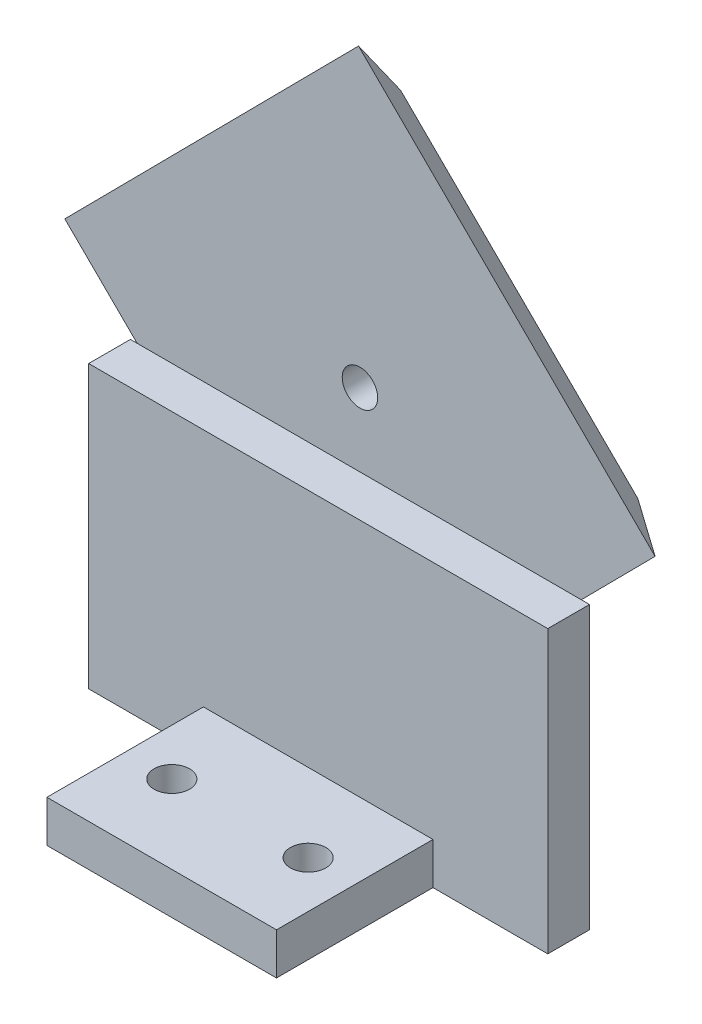
ISO-10303-21;
HEADER;
FILE_DESCRIPTION(('STEP AP214'),'2;1');
FILE_NAME('part.step','',(''),(''),'','','');
FILE_SCHEMA(('AUTOMOTIVE_DESIGN { 1 0 10303 214 1 1 1 1 }'));
ENDSEC;
DATA;
#1=APPLICATION_CONTEXT('core data for automotive mechanical design processes');
#2=APPLICATION_PROTOCOL_DEFINITION('international standard','automotive_design',2000,#1);
#3=PRODUCT_CONTEXT('',#1,'mechanical');
#4=PRODUCT('Part','Part','',(#3));
#5=PRODUCT_RELATED_PRODUCT_CATEGORY('part','',(#4));
#6=PRODUCT_DEFINITION_FORMATION('','',#4);
#7=PRODUCT_DEFINITION_CONTEXT('part definition',#1,'design');
#8=PRODUCT_DEFINITION('design','',#6,#7);
#9=PRODUCT_DEFINITION_SHAPE('','',#8);
#10=(LENGTH_UNIT() NAMED_UNIT(*) SI_UNIT(.MILLI.,.METRE.));
#11=(NAMED_UNIT(*) PLANE_ANGLE_UNIT() SI_UNIT($,.RADIAN.));
#12=(NAMED_UNIT(*) SI_UNIT($,.STERADIAN.) SOLID_ANGLE_UNIT());
#13=UNCERTAINTY_MEASURE_WITH_UNIT(LENGTH_MEASURE(1.E-05),#10,'distance_accuracy_value','');
#14=(GEOMETRIC_REPRESENTATION_CONTEXT(3) GLOBAL_UNCERTAINTY_ASSIGNED_CONTEXT((#13)) GLOBAL_UNIT_ASSIGNED_CONTEXT((#10,
#11,#12)) REPRESENTATION_CONTEXT('',''));
#15=CARTESIAN_POINT('',(0.,0.,0.));
#16=DIRECTION('',(0.,0.,1.));
#17=DIRECTION('',(1.,0.,0.));
#18=AXIS2_PLACEMENT_3D('',#15,#16,#17);
#19=CARTESIAN_POINT('',(0.,27.,-11.5));
#20=DIRECTION('',(0.,0.,-1.));
#21=DIRECTION('',(-1.,0.,0.));
#22=AXIS2_PLACEMENT_3D('',#19,#20,#21);
#23=PLANE('',#22);
#24=DIRECTION('',(1.,0.,0.));
#25=VECTOR('',#24,1.);
#26=CARTESIAN_POINT('',(0.,4.,-11.5));
#27=LINE('',#26,#25);
#28=CARTESIAN_POINT('',(-11.,4.,-11.5));
#29=VERTEX_POINT('',#28);
#30=CARTESIAN_POINT('',(11.,4.,-11.5));
#31=VERTEX_POINT('',#30);
#32=EDGE_CURVE('E183',#29,#31,#27,.T.);
#33=ORIENTED_EDGE('',*,*,#32,.F.);
#34=DIRECTION('',(0.,-1.,0.));
#35=VECTOR('',#34,1.);
#36=CARTESIAN_POINT('',(-11.,4.,-11.5));
#37=LINE('',#36,#35);
#38=CARTESIAN_POINT('',(-11.,0.,-11.5));
#39=VERTEX_POINT('',#38);
#40=EDGE_CURVE('E179',#29,#39,#37,.T.);
#41=ORIENTED_EDGE('',*,*,#40,.T.);
#42=DIRECTION('',(1.,0.,0.));
#43=VECTOR('',#42,1.);
#44=CARTESIAN_POINT('',(0.,0.,-11.5));
#45=LINE('',#44,#43);
#46=CARTESIAN_POINT('',(-22.,0.,-11.5));
#47=VERTEX_POINT('',#46);
#48=EDGE_CURVE('E241',#47,#39,#45,.T.);
#49=ORIENTED_EDGE('',*,*,#48,.F.);
#50=DIRECTION('',(0.,-1.,0.));
#51=VECTOR('',#50,1.);
#52=CARTESIAN_POINT('',(-22.,27.,-11.5));
#53=LINE('',#52,#51);
#54=CARTESIAN_POINT('',(-22.,27.,-11.5));
#55=VERTEX_POINT('',#54);
#56=EDGE_CURVE('E259',#55,#47,#53,.T.);
#57=ORIENTED_EDGE('',*,*,#56,.F.);
#58=DIRECTION('',(1.,0.,0.));
#59=VECTOR('',#58,1.);
#60=CARTESIAN_POINT('',(0.,27.,-11.5));
#61=LINE('',#60,#59);
#62=CARTESIAN_POINT('',(-21.3537768941877,27.,-11.5));
#63=VERTEX_POINT('',#62);
#64=EDGE_CURVE('E223',#55,#63,#61,.T.);
#65=ORIENTED_EDGE('',*,*,#64,.T.);
#66=DIRECTION('',(0.71050638860482,-0.703690750082546,0.));
#67=VECTOR('',#66,1.);
#68=CARTESIAN_POINT('',(-10.5739775869006,16.3236075256414,-11.5));
#69=LINE('',#68,#67);
#70=CARTESIAN_POINT('',(0.13631277044548,5.71605722625266,-11.5));
#71=VERTEX_POINT('',#70);
#72=EDGE_CURVE('E353',#71,#63,#69,.F.);
#73=ORIENTED_EDGE('',*,*,#72,.F.);
#74=DIRECTION('',(0.703690750082546,0.71050638860482,0.));
#75=VECTOR('',#74,1.);
#76=CARTESIAN_POINT('',(10.7102903573461,16.3924497006112,-11.5));
#77=LINE('',#76,#75);
#78=CARTESIAN_POINT('',(21.2160861481097,27.,-11.5));
#79=VERTEX_POINT('',#78);
#80=EDGE_CURVE('E11',#79,#71,#77,.F.);
#81=ORIENTED_EDGE('',*,*,#80,.F.);
#82=CARTESIAN_POINT('',(22.,27.,-11.5));
#83=VERTEX_POINT('',#82);
#84=EDGE_CURVE('E221',#79,#83,#61,.T.);
#85=ORIENTED_EDGE('',*,*,#84,.T.);
#86=DIRECTION('',(0.,-1.,0.));
#87=VECTOR('',#86,1.);
#88=CARTESIAN_POINT('',(22.,27.,-11.5));
#89=LINE('',#88,#87);
#90=CARTESIAN_POINT('',(22.,0.,-11.5));
#91=VERTEX_POINT('',#90);
#92=EDGE_CURVE('E262',#83,#91,#89,.T.);
#93=ORIENTED_EDGE('',*,*,#92,.T.);
#94=CARTESIAN_POINT('',(11.,0.,-11.5));
#95=VERTEX_POINT('',#94);
#96=EDGE_CURVE('E239',#95,#91,#45,.T.);
#97=ORIENTED_EDGE('',*,*,#96,.F.);
#98=DIRECTION('',(0.,-1.,0.));
#99=VECTOR('',#98,1.);
#100=CARTESIAN_POINT('',(11.,4.,-11.5));
#101=LINE('',#100,#99);
#102=EDGE_CURVE('E205',#31,#95,#101,.T.);
#103=ORIENTED_EDGE('',*,*,#102,.F.);
#104=EDGE_LOOP('',(#33,#41,#49,#57,#65,#73,#81,#85,#93,#97,#103));
#105=FACE_BOUND('',#104,.T.);
#106=ADVANCED_FACE('F41',(#105),#23,.T.);
#107=CARTESIAN_POINT('',(0.,0.,0.));
#108=DIRECTION('',(0.,1.,0.));
#109=DIRECTION('',(0.,0.,1.));
#110=AXIS2_PLACEMENT_3D('',#107,#108,#109);
#111=PLANE('',#110);
#112=CARTESIAN_POINT('',(-6.5317185165128,0.,0.));
#113=DIRECTION('',(0.,-1.,0.));
#114=DIRECTION('',(0.,0.,-1.));
#115=AXIS2_PLACEMENT_3D('',#112,#113,#114);
#116=CIRCLE('',#115,3.15);
#117=CARTESIAN_POINT('',(-6.5317185165128,0.,-3.15));
#118=VERTEX_POINT('',#117);
#119=EDGE_CURVE('E278',#118,#118,#116,.T.);
#120=ORIENTED_EDGE('',*,*,#119,.F.);
#121=EDGE_LOOP('',(#120));
#122=FACE_BOUND('',#121,.T.);
#123=DIRECTION('',(0.,0.,1.));
#124=VECTOR('',#123,1.);
#125=CARTESIAN_POINT('',(-11.,0.,0.));
#126=LINE('',#125,#124);
#127=CARTESIAN_POINT('',(-11.,0.,-7.5));
#128=VERTEX_POINT('',#127);
#129=CARTESIAN_POINT('',(-11.,0.,7.5));
#130=VERTEX_POINT('',#129);
#131=EDGE_CURVE('E290',#128,#130,#126,.T.);
#132=ORIENTED_EDGE('',*,*,#131,.F.);
#133=DIRECTION('',(1.,0.,0.));
#134=VECTOR('',#133,1.);
#135=CARTESIAN_POINT('',(0.,0.,-7.5));
#136=LINE('',#135,#134);
#137=CARTESIAN_POINT('',(-22.,0.,-7.5));
#138=VERTEX_POINT('',#137);
#139=EDGE_CURVE('E222',#138,#128,#136,.T.);
#140=ORIENTED_EDGE('',*,*,#139,.F.);
#141=DIRECTION('',(0.,0.,1.));
#142=VECTOR('',#141,1.);
#143=CARTESIAN_POINT('',(-22.,0.,0.));
#144=LINE('',#143,#142);
#145=EDGE_CURVE('E245',#47,#138,#144,.T.);
#146=ORIENTED_EDGE('',*,*,#145,.F.);
#147=ORIENTED_EDGE('',*,*,#48,.T.);
#148=DIRECTION('',(0.,0.,1.));
#149=VECTOR('',#148,1.);
#150=CARTESIAN_POINT('',(-11.,0.,0.));
#151=LINE('',#150,#149);
#152=CARTESIAN_POINT('',(-11.,0.,-21.5));
#153=VERTEX_POINT('',#152);
#154=EDGE_CURVE('E413',#153,#39,#151,.T.);
#155=ORIENTED_EDGE('',*,*,#154,.F.);
#156=DIRECTION('',(-1.,0.,0.));
#157=VECTOR('',#156,1.);
#158=CARTESIAN_POINT('',(0.,0.,-21.5));
#159=LINE('',#158,#157);
#160=CARTESIAN_POINT('',(11.,0.,-21.5));
#161=VERTEX_POINT('',#160);
#162=EDGE_CURVE('E196',#161,#153,#159,.T.);
#163=ORIENTED_EDGE('',*,*,#162,.F.);
#164=DIRECTION('',(0.,0.,-1.));
#165=VECTOR('',#164,1.);
#166=CARTESIAN_POINT('',(11.,0.,0.));
#167=LINE('',#166,#165);
#168=EDGE_CURVE('E59',#95,#161,#167,.T.);
#169=ORIENTED_EDGE('',*,*,#168,.F.);
#170=ORIENTED_EDGE('',*,*,#96,.T.);
#171=DIRECTION('',(0.,0.,1.));
#172=VECTOR('',#171,1.);
#173=CARTESIAN_POINT('',(22.,0.,0.));
#174=LINE('',#173,#172);
#175=CARTESIAN_POINT('',(22.,0.,-7.5));
#176=VERTEX_POINT('',#175);
#177=EDGE_CURVE('E235',#91,#176,#174,.T.);
#178=ORIENTED_EDGE('',*,*,#177,.T.);
#179=CARTESIAN_POINT('',(11.,0.,-7.5));
#180=VERTEX_POINT('',#179);
#181=EDGE_CURVE('E248',#180,#176,#136,.T.);
#182=ORIENTED_EDGE('',*,*,#181,.F.);
#183=DIRECTION('',(0.,0.,1.));
#184=VECTOR('',#183,1.);
#185=CARTESIAN_POINT('',(11.,0.,0.));
#186=LINE('',#185,#184);
#187=CARTESIAN_POINT('',(11.,0.,7.5));
#188=VERTEX_POINT('',#187);
#189=EDGE_CURVE('E296',#180,#188,#186,.T.);
#190=ORIENTED_EDGE('',*,*,#189,.T.);
#191=DIRECTION('',(-1.,0.,0.));
#192=VECTOR('',#191,1.);
#193=CARTESIAN_POINT('',(0.,0.,7.5));
#194=LINE('',#193,#192);
#195=EDGE_CURVE('E311',#188,#130,#194,.T.);
#196=ORIENTED_EDGE('',*,*,#195,.T.);
#197=EDGE_LOOP('',(#132,#140,#146,#147,#155,#163,#169,#170,#178,#182,#190,#196));
#198=FACE_BOUND('',#197,.T.);
#199=CARTESIAN_POINT('',(6.5317185165128,0.,0.));
#200=DIRECTION('',(0.,-1.,0.));
#201=DIRECTION('',(0.,0.,-1.));
#202=AXIS2_PLACEMENT_3D('',#199,#200,#201);
#203=CIRCLE('',#202,3.15);
#204=CARTESIAN_POINT('',(6.5317185165128,0.,-3.15));
#205=VERTEX_POINT('',#204);
#206=EDGE_CURVE('E266',#205,#205,#203,.T.);
#207=ORIENTED_EDGE('',*,*,#206,.F.);
#208=EDGE_LOOP('',(#207));
#209=FACE_BOUND('',#208,.T.);
#210=ADVANCED_FACE('F400',(#122,#198,#209),#111,.F.);
#211=CARTESIAN_POINT('',(-11.,4.,0.));
#212=DIRECTION('',(1.,0.,0.));
#213=DIRECTION('',(0.,0.,-1.));
#214=AXIS2_PLACEMENT_3D('',#211,#212,#213);
#215=PLANE('',#214);
#216=ORIENTED_EDGE('',*,*,#131,.T.);
#217=DIRECTION('',(0.,-1.,0.));
#218=VECTOR('',#217,1.);
#219=CARTESIAN_POINT('',(-11.,4.,7.5));
#220=LINE('',#219,#218);
#221=CARTESIAN_POINT('',(-11.,4.,7.5));
#222=VERTEX_POINT('',#221);
#223=EDGE_CURVE('E324',#222,#130,#220,.T.);
#224=ORIENTED_EDGE('',*,*,#223,.F.);
#225=DIRECTION('',(0.,0.,1.));
#226=VECTOR('',#225,1.);
#227=CARTESIAN_POINT('',(-11.,4.,0.));
#228=LINE('',#227,#226);
#229=CARTESIAN_POINT('',(-11.,4.,-7.5));
#230=VERTEX_POINT('',#229);
#231=EDGE_CURVE('E295',#230,#222,#228,.T.);
#232=ORIENTED_EDGE('',*,*,#231,.F.);
#233=DIRECTION('',(0.,-1.,0.));
#234=VECTOR('',#233,1.);
#235=CARTESIAN_POINT('',(-11.,4.,-7.5));
#236=LINE('',#235,#234);
#237=EDGE_CURVE('E51',#230,#128,#236,.T.);
#238=ORIENTED_EDGE('',*,*,#237,.T.);
#239=EDGE_LOOP('',(#216,#224,#232,#238));
#240=FACE_BOUND('',#239,.T.);
#241=ADVANCED_FACE('F430',(#240),#215,.F.);
#242=CARTESIAN_POINT('',(0.,4.,7.5));
#243=DIRECTION('',(0.,0.,1.));
#244=DIRECTION('',(1.,0.,0.));
#245=AXIS2_PLACEMENT_3D('',#242,#243,#244);
#246=PLANE('',#245);
#247=ORIENTED_EDGE('',*,*,#195,.F.);
#248=DIRECTION('',(0.,-1.,0.));
#249=VECTOR('',#248,1.);
#250=CARTESIAN_POINT('',(11.,4.,7.5));
#251=LINE('',#250,#249);
#252=CARTESIAN_POINT('',(11.,4.,7.5));
#253=VERTEX_POINT('',#252);
#254=EDGE_CURVE('E321',#253,#188,#251,.T.);
#255=ORIENTED_EDGE('',*,*,#254,.F.);
#256=DIRECTION('',(-1.,0.,0.));
#257=VECTOR('',#256,1.);
#258=CARTESIAN_POINT('',(0.,4.,7.5));
#259=LINE('',#258,#257);
#260=EDGE_CURVE('E299',#253,#222,#259,.T.);
#261=ORIENTED_EDGE('',*,*,#260,.T.);
#262=ORIENTED_EDGE('',*,*,#223,.T.);
#263=EDGE_LOOP('',(#247,#255,#261,#262));
#264=FACE_BOUND('',#263,.T.);
#265=ADVANCED_FACE('F439',(#264),#246,.T.);
#266=CARTESIAN_POINT('',(11.,4.,0.));
#267=DIRECTION('',(1.,0.,0.));
#268=DIRECTION('',(0.,0.,-1.));
#269=AXIS2_PLACEMENT_3D('',#266,#267,#268);
#270=PLANE('',#269);
#271=ORIENTED_EDGE('',*,*,#189,.F.);
#272=DIRECTION('',(0.,-1.,0.));
#273=VECTOR('',#272,1.);
#274=CARTESIAN_POINT('',(11.,4.,-7.5));
#275=LINE('',#274,#273);
#276=CARTESIAN_POINT('',(11.,4.,-7.5));
#277=VERTEX_POINT('',#276);
#278=EDGE_CURVE('E307',#277,#180,#275,.T.);
#279=ORIENTED_EDGE('',*,*,#278,.F.);
#280=DIRECTION('',(0.,0.,1.));
#281=VECTOR('',#280,1.);
#282=CARTESIAN_POINT('',(11.,4.,0.));
#283=LINE('',#282,#281);
#284=EDGE_CURVE('E303',#277,#253,#283,.T.);
#285=ORIENTED_EDGE('',*,*,#284,.T.);
#286=ORIENTED_EDGE('',*,*,#254,.T.);
#287=EDGE_LOOP('',(#271,#279,#285,#286));
#288=FACE_BOUND('',#287,.T.);
#289=ADVANCED_FACE('F437',(#288),#270,.T.);
#290=CARTESIAN_POINT('',(0.,4.,0.));
#291=DIRECTION('',(0.,1.,0.));
#292=DIRECTION('',(0.,0.,1.));
#293=AXIS2_PLACEMENT_3D('',#290,#291,#292);
#294=PLANE('',#293);
#295=CARTESIAN_POINT('',(6.5317185165128,4.,0.));
#296=DIRECTION('',(0.,1.,0.));
#297=DIRECTION('',(0.,0.,1.));
#298=AXIS2_PLACEMENT_3D('',#295,#296,#297);
#299=CIRCLE('',#298,1.69999999999999);
#300=CARTESIAN_POINT('',(6.5317185165128,4.,1.69999999999999));
#301=VERTEX_POINT('',#300);
#302=EDGE_CURVE('E274',#301,#301,#299,.T.);
#303=ORIENTED_EDGE('',*,*,#302,.F.);
#304=EDGE_LOOP('',(#303));
#305=FACE_BOUND('',#304,.T.);
#306=CARTESIAN_POINT('',(-6.5317185165128,4.,0.));
#307=DIRECTION('',(0.,1.,0.));
#308=DIRECTION('',(0.,0.,1.));
#309=AXIS2_PLACEMENT_3D('',#306,#307,#308);
#310=CIRCLE('',#309,1.69999999999999);
#311=CARTESIAN_POINT('',(-6.5317185165128,4.,1.69999999999999));
#312=VERTEX_POINT('',#311);
#313=EDGE_CURVE('E286',#312,#312,#310,.T.);
#314=ORIENTED_EDGE('',*,*,#313,.F.);
#315=EDGE_LOOP('',(#314));
#316=FACE_BOUND('',#315,.T.);
#317=DIRECTION('',(-1.,0.,0.));
#318=VECTOR('',#317,1.);
#319=CARTESIAN_POINT('',(0.,4.,-7.5));
#320=LINE('',#319,#318);
#321=EDGE_CURVE('E291',#277,#230,#320,.T.);
#322=ORIENTED_EDGE('',*,*,#321,.T.);
#323=ORIENTED_EDGE('',*,*,#231,.T.);
#324=ORIENTED_EDGE('',*,*,#260,.F.);
#325=ORIENTED_EDGE('',*,*,#284,.F.);
#326=EDGE_LOOP('',(#322,#323,#324,#325));
#327=FACE_BOUND('',#326,.T.);
#328=ADVANCED_FACE('F434',(#305,#316,#327),#294,.T.);
#329=CARTESIAN_POINT('',(-6.5317185165128,0.,0.));
#330=DIRECTION('',(0.,-1.,0.));
#331=DIRECTION('',(0.,0.,-1.));
#332=AXIS2_PLACEMENT_3D('',#329,#330,#331);
#333=CYLINDRICAL_SURFACE('',#332,1.69999999999999);
#334=CARTESIAN_POINT('',(-6.5317185165128,1.45000000000001,0.));
#335=DIRECTION('',(0.,-1.,0.));
#336=DIRECTION('',(0.,0.,-1.));
#337=AXIS2_PLACEMENT_3D('',#334,#335,#336);
#338=CIRCLE('',#337,1.69999999999999);
#339=CARTESIAN_POINT('',(-6.5317185165128,1.45000000000001,-1.69999999999999));
#340=VERTEX_POINT('',#339);
#341=EDGE_CURVE('E282',#340,#340,#338,.T.);
#342=ORIENTED_EDGE('',*,*,#341,.T.);
#343=EDGE_LOOP('',(#342));
#344=FACE_BOUND('',#343,.T.);
#345=ORIENTED_EDGE('',*,*,#313,.T.);
#346=EDGE_LOOP('',(#345));
#347=FACE_BOUND('',#346,.T.);
#348=ADVANCED_FACE('F471',(#344,#347),#333,.F.);
#349=CARTESIAN_POINT('',(-6.5317185165128,0.,0.));
#350=DIRECTION('',(0.,-1.,0.));
#351=DIRECTION('',(0.,0.,-1.));
#352=AXIS2_PLACEMENT_3D('',#349,#350,#351);
#353=CONICAL_SURFACE('',#352,3.15,0.78539816339745);
#354=ORIENTED_EDGE('',*,*,#341,.F.);
#355=EDGE_LOOP('',(#354));
#356=FACE_BOUND('',#355,.T.);
#357=ORIENTED_EDGE('',*,*,#119,.T.);
#358=EDGE_LOOP('',(#357));
#359=FACE_BOUND('',#358,.T.);
#360=ADVANCED_FACE('F467',(#356,#359),#353,.F.);
#361=CARTESIAN_POINT('',(6.5317185165128,0.,0.));
#362=DIRECTION('',(0.,-1.,0.));
#363=DIRECTION('',(0.,0.,-1.));
#364=AXIS2_PLACEMENT_3D('',#361,#362,#363);
#365=CYLINDRICAL_SURFACE('',#364,1.69999999999999);
#366=CARTESIAN_POINT('',(6.5317185165128,1.45000000000001,0.));
#367=DIRECTION('',(0.,-1.,0.));
#368=DIRECTION('',(0.,0.,-1.));
#369=AXIS2_PLACEMENT_3D('',#366,#367,#368);
#370=CIRCLE('',#369,1.69999999999999);
#371=CARTESIAN_POINT('',(6.5317185165128,1.45000000000001,-1.69999999999999));
#372=VERTEX_POINT('',#371);
#373=EDGE_CURVE('E270',#372,#372,#370,.T.);
#374=ORIENTED_EDGE('',*,*,#373,.T.);
#375=EDGE_LOOP('',(#374));
#376=FACE_BOUND('',#375,.T.);
#377=ORIENTED_EDGE('',*,*,#302,.T.);
#378=EDGE_LOOP('',(#377));
#379=FACE_BOUND('',#378,.T.);
#380=ADVANCED_FACE('F463',(#376,#379),#365,.F.);
#381=CARTESIAN_POINT('',(6.5317185165128,0.,0.));
#382=DIRECTION('',(0.,-1.,0.));
#383=DIRECTION('',(0.,0.,-1.));
#384=AXIS2_PLACEMENT_3D('',#381,#382,#383);
#385=CONICAL_SURFACE('',#384,3.15,0.78539816339745);
#386=ORIENTED_EDGE('',*,*,#373,.F.);
#387=EDGE_LOOP('',(#386));
#388=FACE_BOUND('',#387,.T.);
#389=ORIENTED_EDGE('',*,*,#206,.T.);
#390=EDGE_LOOP('',(#389));
#391=FACE_BOUND('',#390,.T.);
#392=ADVANCED_FACE('F460',(#388,#391),#385,.F.);
#393=CARTESIAN_POINT('',(22.,27.,0.));
#394=DIRECTION('',(1.,0.,0.));
#395=DIRECTION('',(0.,0.,-1.));
#396=AXIS2_PLACEMENT_3D('',#393,#394,#395);
#397=PLANE('',#396);
#398=ORIENTED_EDGE('',*,*,#177,.F.);
#399=ORIENTED_EDGE('',*,*,#92,.F.);
#400=DIRECTION('',(0.,0.,1.));
#401=VECTOR('',#400,1.);
#402=CARTESIAN_POINT('',(22.,27.,0.));
#403=LINE('',#402,#401);
#404=CARTESIAN_POINT('',(22.,27.,-7.5));
#405=VERTEX_POINT('',#404);
#406=EDGE_CURVE('E217',#83,#405,#403,.T.);
#407=ORIENTED_EDGE('',*,*,#406,.T.);
#408=DIRECTION('',(0.,-1.,0.));
#409=VECTOR('',#408,1.);
#410=CARTESIAN_POINT('',(22.,27.,-7.5));
#411=LINE('',#410,#409);
#412=EDGE_CURVE('E234',#405,#176,#411,.T.);
#413=ORIENTED_EDGE('',*,*,#412,.T.);
#414=EDGE_LOOP('',(#398,#399,#407,#413));
#415=FACE_BOUND('',#414,.T.);
#416=ADVANCED_FACE('F390',(#415),#397,.T.);
#417=CARTESIAN_POINT('',(-22.,27.,0.));
#418=DIRECTION('',(1.,0.,0.));
#419=DIRECTION('',(0.,0.,-1.));
#420=AXIS2_PLACEMENT_3D('',#417,#418,#419);
#421=PLANE('',#420);
#422=ORIENTED_EDGE('',*,*,#145,.T.);
#423=DIRECTION('',(0.,-1.,0.));
#424=VECTOR('',#423,1.);
#425=CARTESIAN_POINT('',(-22.,27.,-7.5));
#426=LINE('',#425,#424);
#427=CARTESIAN_POINT('',(-22.,27.,-7.5));
#428=VERTEX_POINT('',#427);
#429=EDGE_CURVE('E255',#428,#138,#426,.T.);
#430=ORIENTED_EDGE('',*,*,#429,.F.);
#431=DIRECTION('',(0.,0.,1.));
#432=VECTOR('',#431,1.);
#433=CARTESIAN_POINT('',(-22.,27.,0.));
#434=LINE('',#433,#432);
#435=EDGE_CURVE('E227',#55,#428,#434,.T.);
#436=ORIENTED_EDGE('',*,*,#435,.F.);
#437=ORIENTED_EDGE('',*,*,#56,.T.);
#438=EDGE_LOOP('',(#422,#430,#436,#437));
#439=FACE_BOUND('',#438,.T.);
#440=ADVANCED_FACE('F425',(#439),#421,.F.);
#441=CARTESIAN_POINT('',(0.,27.,-7.5));
#442=DIRECTION('',(0.,0.,-1.));
#443=DIRECTION('',(-1.,0.,0.));
#444=AXIS2_PLACEMENT_3D('',#441,#442,#443);
#445=PLANE('',#444);
#446=ORIENTED_EDGE('',*,*,#237,.F.);
#447=ORIENTED_EDGE('',*,*,#321,.F.);
#448=ORIENTED_EDGE('',*,*,#278,.T.);
#449=ORIENTED_EDGE('',*,*,#181,.T.);
#450=ORIENTED_EDGE('',*,*,#412,.F.);
#451=DIRECTION('',(1.,0.,0.));
#452=VECTOR('',#451,1.);
#453=CARTESIAN_POINT('',(0.,27.,-7.5));
#454=LINE('',#453,#452);
#455=EDGE_CURVE('E231',#428,#405,#454,.T.);
#456=ORIENTED_EDGE('',*,*,#455,.F.);
#457=ORIENTED_EDGE('',*,*,#429,.T.);
#458=ORIENTED_EDGE('',*,*,#139,.T.);
#459=EDGE_LOOP('',(#446,#447,#448,#449,#450,#456,#457,#458));
#460=FACE_BOUND('',#459,.T.);
#461=ADVANCED_FACE('F398',(#460),#445,.F.);
#462=CARTESIAN_POINT('',(0.,27.,0.));
#463=DIRECTION('',(0.,1.,0.));
#464=DIRECTION('',(0.,0.,1.));
#465=AXIS2_PLACEMENT_3D('',#462,#463,#464);
#466=PLANE('',#465);
#467=ORIENTED_EDGE('',*,*,#406,.F.);
#468=ORIENTED_EDGE('',*,*,#84,.F.);
#469=EDGE_CURVE('E228',#63,#79,#61,.T.);
#470=ORIENTED_EDGE('',*,*,#469,.F.);
#471=ORIENTED_EDGE('',*,*,#64,.F.);
#472=ORIENTED_EDGE('',*,*,#435,.T.);
#473=ORIENTED_EDGE('',*,*,#455,.T.);
#474=EDGE_LOOP('',(#467,#468,#470,#471,#472,#473));
#475=FACE_BOUND('',#474,.T.);
#476=ADVANCED_FACE('F391',(#475),#466,.T.);
#477=CARTESIAN_POINT('',(0.,0.,-11.5));
#478=DIRECTION('',(0.,0.,-1.));
#479=DIRECTION('',(-1.,0.,0.));
#480=AXIS2_PLACEMENT_3D('',#477,#478,#479);
#481=PLANE('',#480);
#482=CARTESIAN_POINT('',(0.,34.,-11.5));
#483=DIRECTION('',(0.,0.,-1.));
#484=DIRECTION('',(-1.,0.,0.));
#485=AXIS2_PLACEMENT_3D('',#482,#483,#484);
#486=CIRCLE('',#485,1.69999999999999);
#487=CARTESIAN_POINT('',(-1.7,34.,-11.5));
#488=VERTEX_POINT('',#487);
#489=EDGE_CURVE('E212',#488,#488,#486,.T.);
#490=ORIENTED_EDGE('',*,*,#489,.T.);
#491=EDGE_LOOP('',(#490));
#492=FACE_BOUND('',#491,.T.);
#493=DIRECTION('',(0.71050638860482,-0.703690750082546,0.));
#494=VECTOR('',#493,1.);
#495=CARTESIAN_POINT('',(-10.5739775869006,16.3236075256414,-11.5));
#496=LINE('',#495,#494);
#497=CARTESIAN_POINT('',(-28.2839427737473,33.8636872295545,-11.5));
#498=VERTEX_POINT('',#497);
#499=EDGE_CURVE('E347',#63,#498,#496,.F.);
#500=ORIENTED_EDGE('',*,*,#499,.F.);
#501=ORIENTED_EDGE('',*,*,#469,.T.);
#502=DIRECTION('',(0.703690750082546,0.71050638860482,0.));
#503=VECTOR('',#502,1.);
#504=CARTESIAN_POINT('',(10.7102903573461,16.3924497006112,-11.5));
#505=LINE('',#504,#503);
#506=CARTESIAN_POINT('',(28.2839427737473,34.1363127704455,-11.5));
#507=VERTEX_POINT('',#506);
#508=EDGE_CURVE('E343',#507,#79,#505,.F.);
#509=ORIENTED_EDGE('',*,*,#508,.F.);
#510=DIRECTION('',(-0.71050638860482,0.703690750082546,0.));
#511=VECTOR('',#510,1.);
#512=CARTESIAN_POINT('',(17.5736524164013,44.7438630698343,-11.5));
#513=LINE('',#512,#511);
#514=CARTESIAN_POINT('',(-0.13631277044548,62.2839427737473,-11.5));
#515=VERTEX_POINT('',#514);
#516=EDGE_CURVE('E216',#515,#507,#513,.F.);
#517=ORIENTED_EDGE('',*,*,#516,.F.);
#518=DIRECTION('',(-0.703690750082546,-0.71050638860482,0.));
#519=VECTOR('',#518,1.);
#520=CARTESIAN_POINT('',(-17.7099651868468,44.5400797039131,-11.5));
#521=LINE('',#520,#519);
#522=EDGE_CURVE('E98',#498,#515,#521,.F.);
#523=ORIENTED_EDGE('',*,*,#522,.F.);
#524=EDGE_LOOP('',(#500,#501,#509,#517,#523));
#525=FACE_BOUND('',#524,.T.);
#526=ADVANCED_FACE('F380',(#492,#525),#481,.F.);
#527=CARTESIAN_POINT('',(17.5736524164013,44.7438630698343,-11.5));
#528=DIRECTION('',(0.497584501241616,0.502403885458832,-0.707106781186549));
#529=DIRECTION('',(0.,0.815188078124783,0.579196337422141));
#530=AXIS2_PLACEMENT_3D('',#527,#528,#529);
#531=PLANE('',#530);
#532=ORIENTED_EDGE('',*,*,#516,.T.);
#533=DIRECTION('',(0.81648709870835,0.00393501073553403,0.577350269189625));
#534=VECTOR('',#533,1.);
#535=CARTESIAN_POINT('',(16.5114376116688,34.0795758859678,-19.8245149067446));
#536=LINE('',#535,#534);
#537=CARTESIAN_POINT('',(22.6271542189978,34.1090502163564,-15.5));
#538=VERTEX_POINT('',#537);
#539=EDGE_CURVE('E240',#538,#507,#536,.T.);
#540=ORIENTED_EDGE('',*,*,#539,.F.);
#541=DIRECTION('',(-0.71050638860482,0.703690750082546,0.));
#542=VECTOR('',#541,1.);
#543=CARTESIAN_POINT('',(14.7588894160711,41.901837515415,-15.5));
#544=LINE('',#543,#542);
#545=CARTESIAN_POINT('',(-0.109050216356383,56.6271542189978,-15.5));
#546=VERTEX_POINT('',#545);
#547=EDGE_CURVE('E45',#546,#538,#544,.F.);
#548=ORIENTED_EDGE('',*,*,#547,.F.);
#549=DIRECTION('',(-0.00393501073553406,0.81648709870835,0.577350269189625));
#550=VECTOR('',#549,1.);
#551=CARTESIAN_POINT('',(-0.0796842761342474,50.5339278101607,-19.8086117501926));
#552=LINE('',#551,#550);
#553=EDGE_CURVE('E337',#546,#515,#552,.T.);
#554=ORIENTED_EDGE('',*,*,#553,.T.);
#555=EDGE_LOOP('',(#532,#540,#548,#554));
#556=FACE_BOUND('',#555,.T.);
#557=ADVANCED_FACE('F374',(#556),#531,.T.);
#558=CARTESIAN_POINT('',(10.7102903573461,16.3924497006112,-11.5));
#559=DIRECTION('',(0.502403885458832,-0.497584501241616,-0.707106781186549));
#560=DIRECTION('',(-0.815188078124783,0.,-0.579196337422141));
#561=AXIS2_PLACEMENT_3D('',#558,#559,#560);
#562=PLANE('',#561);
#563=ORIENTED_EDGE('',*,*,#508,.T.);
#564=ORIENTED_EDGE('',*,*,#80,.T.);
#565=DIRECTION('',(0.00393501073553422,-0.81648709870835,0.577350269189625));
#566=VECTOR('',#565,1.);
#567=CARTESIAN_POINT('',(0.102066084459722,12.822004111831,-16.5247215831407));
#568=LINE('',#567,#566);
#569=CARTESIAN_POINT('',(0.109050216356383,11.3728457810021,-15.5));
#570=VERTEX_POINT('',#569);
#571=EDGE_CURVE('E330',#570,#71,#568,.T.);
#572=ORIENTED_EDGE('',*,*,#571,.F.);
#573=DIRECTION('',(0.703690750082546,0.71050638860482,0.));
#574=VECTOR('',#573,1.);
#575=CARTESIAN_POINT('',(7.86826480292676,19.2072127009414,-15.5));
#576=LINE('',#575,#574);
#577=EDGE_CURVE('E89',#538,#570,#576,.F.);
#578=ORIENTED_EDGE('',*,*,#577,.F.);
#579=ORIENTED_EDGE('',*,*,#539,.T.);
#580=EDGE_LOOP('',(#563,#564,#572,#578,#579));
#581=FACE_BOUND('',#580,.T.);
#582=ADVANCED_FACE('F376',(#581),#562,.T.);
#583=CARTESIAN_POINT('',(-10.5739775869006,16.3236075256414,-11.5));
#584=DIRECTION('',(-0.497584501241615,-0.502403885458832,-0.707106781186549));
#585=DIRECTION('',(0.,0.815188078124783,-0.579196337422141));
#586=AXIS2_PLACEMENT_3D('',#583,#584,#585);
#587=PLANE('',#586);
#588=ORIENTED_EDGE('',*,*,#72,.T.);
#589=ORIENTED_EDGE('',*,*,#499,.T.);
#590=DIRECTION('',(-0.81648709870835,-0.00393501073553415,0.577350269189624));
#591=VECTOR('',#590,1.);
#592=CARTESIAN_POINT('',(-21.2004860866609,33.8978255253738,-16.5088184265888));
#593=LINE('',#592,#591);
#594=CARTESIAN_POINT('',(-22.6271542189979,33.8909497836436,-15.5));
#595=VERTEX_POINT('',#594);
#596=EDGE_CURVE('E334',#595,#498,#593,.T.);
#597=ORIENTED_EDGE('',*,*,#596,.F.);
#598=DIRECTION('',(0.71050638860482,-0.703690750082546,0.));
#599=VECTOR('',#598,1.);
#600=CARTESIAN_POINT('',(-7.75921458657038,19.1656330800607,-15.5));
#601=LINE('',#600,#599);
#602=EDGE_CURVE('E361',#570,#595,#601,.F.);
#603=ORIENTED_EDGE('',*,*,#602,.F.);
#604=ORIENTED_EDGE('',*,*,#571,.T.);
#605=EDGE_LOOP('',(#588,#589,#597,#603,#604));
#606=FACE_BOUND('',#605,.T.);
#607=ADVANCED_FACE('F43',(#606),#587,.T.);
#608=CARTESIAN_POINT('',(-17.7099651868468,44.5400797039131,-11.5));
#609=DIRECTION('',(-0.502403885458832,0.497584501241616,-0.707106781186549));
#610=DIRECTION('',(-0.815188078124783,0.,0.579196337422141));
#611=AXIS2_PLACEMENT_3D('',#608,#609,#610);
#612=PLANE('',#611);
#613=ORIENTED_EDGE('',*,*,#522,.T.);
#614=ORIENTED_EDGE('',*,*,#553,.F.);
#615=DIRECTION('',(-0.703690750082546,-0.71050638860482,0.));
#616=VECTOR('',#615,1.);
#617=CARTESIAN_POINT('',(-14.8679396324275,41.7253167035829,-15.5));
#618=LINE('',#617,#616);
#619=EDGE_CURVE('E340',#595,#546,#618,.F.);
#620=ORIENTED_EDGE('',*,*,#619,.F.);
#621=ORIENTED_EDGE('',*,*,#596,.T.);
#622=EDGE_LOOP('',(#613,#614,#620,#621));
#623=FACE_BOUND('',#622,.T.);
#624=ADVANCED_FACE('F371',(#623),#612,.T.);
#625=CARTESIAN_POINT('',(0.,0.,-15.5));
#626=DIRECTION('',(0.,0.,-1.));
#627=DIRECTION('',(-1.,0.,0.));
#628=AXIS2_PLACEMENT_3D('',#625,#626,#627);
#629=PLANE('',#628);
#630=CARTESIAN_POINT('',(0.,34.,-15.5));
#631=DIRECTION('',(0.,0.,-1.));
#632=DIRECTION('',(-1.,0.,0.));
#633=AXIS2_PLACEMENT_3D('',#630,#631,#632);
#634=CIRCLE('',#633,3.15);
#635=CARTESIAN_POINT('',(-3.15000000000001,34.,-15.5));
#636=VERTEX_POINT('',#635);
#637=EDGE_CURVE('E198',#636,#636,#634,.T.);
#638=ORIENTED_EDGE('',*,*,#637,.F.);
#639=EDGE_LOOP('',(#638));
#640=FACE_BOUND('',#639,.T.);
#641=ORIENTED_EDGE('',*,*,#547,.T.);
#642=ORIENTED_EDGE('',*,*,#577,.T.);
#643=ORIENTED_EDGE('',*,*,#602,.T.);
#644=ORIENTED_EDGE('',*,*,#619,.T.);
#645=EDGE_LOOP('',(#641,#642,#643,#644));
#646=FACE_BOUND('',#645,.T.);
#647=ADVANCED_FACE('F366',(#640,#646),#629,.T.);
#648=CARTESIAN_POINT('',(0.,34.,-15.5));
#649=DIRECTION('',(0.,0.,-1.));
#650=DIRECTION('',(-1.,0.,0.));
#651=AXIS2_PLACEMENT_3D('',#648,#649,#650);
#652=CYLINDRICAL_SURFACE('',#651,1.69999999999999);
#653=ORIENTED_EDGE('',*,*,#489,.F.);
#654=EDGE_LOOP('',(#653));
#655=FACE_BOUND('',#654,.T.);
#656=CARTESIAN_POINT('',(0.,34.,-14.05));
#657=DIRECTION('',(0.,0.,-1.));
#658=DIRECTION('',(-1.,0.,0.));
#659=AXIS2_PLACEMENT_3D('',#656,#657,#658);
#660=CIRCLE('',#659,1.69999999999999);
#661=CARTESIAN_POINT('',(-1.69999999999999,34.,-14.05));
#662=VERTEX_POINT('',#661);
#663=EDGE_CURVE('E203',#662,#662,#660,.T.);
#664=ORIENTED_EDGE('',*,*,#663,.T.);
#665=EDGE_LOOP('',(#664));
#666=FACE_BOUND('',#665,.T.);
#667=ADVANCED_FACE('F560',(#655,#666),#652,.F.);
#668=CARTESIAN_POINT('',(0.,34.,-15.5));
#669=DIRECTION('',(0.,0.,-1.));
#670=DIRECTION('',(-1.,0.,0.));
#671=AXIS2_PLACEMENT_3D('',#668,#669,#670);
#672=CONICAL_SURFACE('',#671,3.15,0.78539816339745);
#673=ORIENTED_EDGE('',*,*,#663,.F.);
#674=EDGE_LOOP('',(#673));
#675=FACE_BOUND('',#674,.T.);
#676=ORIENTED_EDGE('',*,*,#637,.T.);
#677=EDGE_LOOP('',(#676));
#678=FACE_BOUND('',#677,.T.);
#679=ADVANCED_FACE('F568',(#675,#678),#672,.F.);
#680=CARTESIAN_POINT('',(0.,4.,-21.5));
#681=DIRECTION('',(0.,0.,1.));
#682=DIRECTION('',(1.,0.,0.));
#683=AXIS2_PLACEMENT_3D('',#680,#681,#682);
#684=PLANE('',#683);
#685=ORIENTED_EDGE('',*,*,#162,.T.);
#686=DIRECTION('',(0.,-1.,0.));
#687=VECTOR('',#686,1.);
#688=CARTESIAN_POINT('',(-11.,4.,-21.5));
#689=LINE('',#688,#687);
#690=CARTESIAN_POINT('',(-11.,4.,-21.5));
#691=VERTEX_POINT('',#690);
#692=EDGE_CURVE('E176',#691,#153,#689,.T.);
#693=ORIENTED_EDGE('',*,*,#692,.F.);
#694=DIRECTION('',(-1.,0.,0.));
#695=VECTOR('',#694,1.);
#696=CARTESIAN_POINT('',(0.,4.,-21.5));
#697=LINE('',#696,#695);
#698=CARTESIAN_POINT('',(11.,4.,-21.5));
#699=VERTEX_POINT('',#698);
#700=EDGE_CURVE('E184',#699,#691,#697,.T.);
#701=ORIENTED_EDGE('',*,*,#700,.F.);
#702=DIRECTION('',(0.,-1.,0.));
#703=VECTOR('',#702,1.);
#704=CARTESIAN_POINT('',(11.,4.,-21.5));
#705=LINE('',#704,#703);
#706=EDGE_CURVE('E407',#699,#161,#705,.T.);
#707=ORIENTED_EDGE('',*,*,#706,.T.);
#708=EDGE_LOOP('',(#685,#693,#701,#707));
#709=FACE_BOUND('',#708,.T.);
#710=ADVANCED_FACE('F195',(#709),#684,.F.);
#711=CARTESIAN_POINT('',(-11.,4.,0.));
#712=DIRECTION('',(1.,0.,0.));
#713=DIRECTION('',(0.,0.,-1.));
#714=AXIS2_PLACEMENT_3D('',#711,#712,#713);
#715=PLANE('',#714);
#716=ORIENTED_EDGE('',*,*,#154,.T.);
#717=ORIENTED_EDGE('',*,*,#40,.F.);
#718=DIRECTION('',(0.,0.,1.));
#719=VECTOR('',#718,1.);
#720=CARTESIAN_POINT('',(-11.,4.,0.));
#721=LINE('',#720,#719);
#722=EDGE_CURVE('E172',#691,#29,#721,.T.);
#723=ORIENTED_EDGE('',*,*,#722,.F.);
#724=ORIENTED_EDGE('',*,*,#692,.T.);
#725=EDGE_LOOP('',(#716,#717,#723,#724));
#726=FACE_BOUND('',#725,.T.);
#727=ADVANCED_FACE('F174',(#726),#715,.F.);
#728=CARTESIAN_POINT('',(11.,4.,0.));
#729=DIRECTION('',(-1.,0.,0.));
#730=DIRECTION('',(0.,0.,1.));
#731=AXIS2_PLACEMENT_3D('',#728,#729,#730);
#732=PLANE('',#731);
#733=ORIENTED_EDGE('',*,*,#168,.T.);
#734=ORIENTED_EDGE('',*,*,#706,.F.);
#735=DIRECTION('',(0.,0.,-1.));
#736=VECTOR('',#735,1.);
#737=CARTESIAN_POINT('',(11.,4.,0.));
#738=LINE('',#737,#736);
#739=EDGE_CURVE('E189',#31,#699,#738,.T.);
#740=ORIENTED_EDGE('',*,*,#739,.F.);
#741=ORIENTED_EDGE('',*,*,#102,.T.);
#742=EDGE_LOOP('',(#733,#734,#740,#741));
#743=FACE_BOUND('',#742,.T.);
#744=ADVANCED_FACE('F421',(#743),#732,.F.);
#745=CARTESIAN_POINT('',(0.,4.,0.));
#746=DIRECTION('',(0.,1.,0.));
#747=DIRECTION('',(0.,0.,1.));
#748=AXIS2_PLACEMENT_3D('',#745,#746,#747);
#749=PLANE('',#748);
#750=ORIENTED_EDGE('',*,*,#700,.T.);
#751=ORIENTED_EDGE('',*,*,#722,.T.);
#752=ORIENTED_EDGE('',*,*,#32,.T.);
#753=ORIENTED_EDGE('',*,*,#739,.T.);
#754=EDGE_LOOP('',(#750,#751,#752,#753));
#755=FACE_BOUND('',#754,.T.);
#756=ADVANCED_FACE('F187',(#755),#749,.T.);
#757=CLOSED_SHELL('',(#106,#210,#241,#265,#289,#328,#348,#360,#380,#392,#416,#440,#461,#476,
#526,#557,#582,#607,#624,#647,#667,#679,#710,#727,#744,#756));
#758=MANIFOLD_SOLID_BREP('B2',#757);
#759=ADVANCED_BREP_SHAPE_REPRESENTATION('',(#18,#758),#14);
#760=SHAPE_DEFINITION_REPRESENTATION(#9,#759);
ENDSEC;
END-ISO-10303-21;
